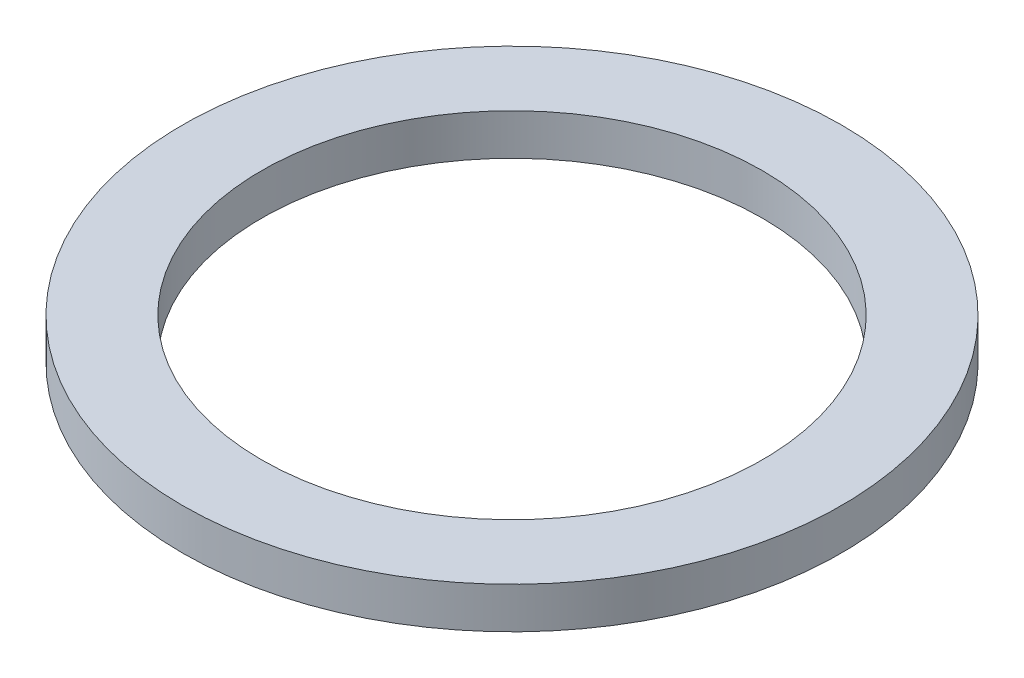
ISO-10303-21;
HEADER;
FILE_DESCRIPTION(('STEP AP214'),'2;1');
FILE_NAME('part.step','',(''),(''),'','','');
FILE_SCHEMA(('AUTOMOTIVE_DESIGN { 1 0 10303 214 1 1 1 1 }'));
ENDSEC;
DATA;
#1=APPLICATION_CONTEXT('core data for automotive mechanical design processes');
#2=APPLICATION_PROTOCOL_DEFINITION('international standard','automotive_design',2000,#1);
#3=PRODUCT_CONTEXT('',#1,'mechanical');
#4=PRODUCT('Part','Part','',(#3));
#5=PRODUCT_RELATED_PRODUCT_CATEGORY('part','',(#4));
#6=PRODUCT_DEFINITION_FORMATION('','',#4);
#7=PRODUCT_DEFINITION_CONTEXT('part definition',#1,'design');
#8=PRODUCT_DEFINITION('design','',#6,#7);
#9=PRODUCT_DEFINITION_SHAPE('','',#8);
#10=(LENGTH_UNIT() NAMED_UNIT(*) SI_UNIT(.MILLI.,.METRE.));
#11=(NAMED_UNIT(*) PLANE_ANGLE_UNIT() SI_UNIT($,.RADIAN.));
#12=(NAMED_UNIT(*) SI_UNIT($,.STERADIAN.) SOLID_ANGLE_UNIT());
#13=UNCERTAINTY_MEASURE_WITH_UNIT(LENGTH_MEASURE(1.E-05),#10,'distance_accuracy_value','');
#14=(GEOMETRIC_REPRESENTATION_CONTEXT(3) GLOBAL_UNCERTAINTY_ASSIGNED_CONTEXT((#13)) GLOBAL_UNIT_ASSIGNED_CONTEXT((#10,
#11,#12)) REPRESENTATION_CONTEXT('',''));
#15=CARTESIAN_POINT('',(0.,0.,0.));
#16=DIRECTION('',(0.,0.,1.));
#17=DIRECTION('',(1.,0.,0.));
#18=AXIS2_PLACEMENT_3D('',#15,#16,#17);
#19=CARTESIAN_POINT('',(0.,1.5875,0.));
#20=DIRECTION('',(0.,1.,0.));
#21=DIRECTION('',(0.,0.,1.));
#22=AXIS2_PLACEMENT_3D('',#19,#20,#21);
#23=PLANE('',#22);
#24=CARTESIAN_POINT('',(0.,1.5875,0.));
#25=DIRECTION('',(0.,1.,0.));
#26=DIRECTION('',(0.,0.,1.));
#27=AXIS2_PLACEMENT_3D('',#24,#25,#26);
#28=CIRCLE('',#27,12.7);
#29=CARTESIAN_POINT('',(0.,1.5875,12.7));
#30=VERTEX_POINT('',#29);
#31=EDGE_CURVE('E10',#30,#30,#28,.T.);
#32=ORIENTED_EDGE('',*,*,#31,.T.);
#33=EDGE_LOOP('',(#32));
#34=FACE_BOUND('',#33,.T.);
#35=CARTESIAN_POINT('',(0.,1.5875,0.));
#36=DIRECTION('',(0.,1.,0.));
#37=DIRECTION('',(0.,0.,1.));
#38=AXIS2_PLACEMENT_3D('',#35,#36,#37);
#39=CIRCLE('',#38,9.652);
#40=CARTESIAN_POINT('',(0.,1.5875,9.652));
#41=VERTEX_POINT('',#40);
#42=EDGE_CURVE('E50',#41,#41,#39,.T.);
#43=ORIENTED_EDGE('',*,*,#42,.F.);
#44=EDGE_LOOP('',(#43));
#45=FACE_BOUND('',#44,.T.);
#46=ADVANCED_FACE('F36',(#34,#45),#23,.T.);
#47=CARTESIAN_POINT('',(0.,0.,0.));
#48=DIRECTION('',(0.,1.,0.));
#49=DIRECTION('',(0.,0.,1.));
#50=AXIS2_PLACEMENT_3D('',#47,#48,#49);
#51=PLANE('',#50);
#52=CARTESIAN_POINT('',(0.,0.,0.));
#53=DIRECTION('',(0.,1.,0.));
#54=DIRECTION('',(0.,0.,1.));
#55=AXIS2_PLACEMENT_3D('',#52,#53,#54);
#56=CIRCLE('',#55,12.7);
#57=CARTESIAN_POINT('',(0.,0.,12.7));
#58=VERTEX_POINT('',#57);
#59=EDGE_CURVE('E40',#58,#58,#56,.T.);
#60=ORIENTED_EDGE('',*,*,#59,.F.);
#61=EDGE_LOOP('',(#60));
#62=FACE_BOUND('',#61,.T.);
#63=CARTESIAN_POINT('',(0.,0.,0.));
#64=DIRECTION('',(0.,1.,0.));
#65=DIRECTION('',(0.,0.,1.));
#66=AXIS2_PLACEMENT_3D('',#63,#64,#65);
#67=CIRCLE('',#66,9.652);
#68=CARTESIAN_POINT('',(0.,0.,9.652));
#69=VERTEX_POINT('',#68);
#70=EDGE_CURVE('E52',#69,#69,#67,.T.);
#71=ORIENTED_EDGE('',*,*,#70,.T.);
#72=EDGE_LOOP('',(#71));
#73=FACE_BOUND('',#72,.T.);
#74=ADVANCED_FACE('F63',(#62,#73),#51,.F.);
#75=CARTESIAN_POINT('',(0.,1.5875,0.));
#76=DIRECTION('',(0.,-1.,0.));
#77=DIRECTION('',(0.,0.,-1.));
#78=AXIS2_PLACEMENT_3D('',#75,#76,#77);
#79=CYLINDRICAL_SURFACE('',#78,12.7);
#80=ORIENTED_EDGE('',*,*,#31,.F.);
#81=EDGE_LOOP('',(#80));
#82=FACE_BOUND('',#81,.T.);
#83=ORIENTED_EDGE('',*,*,#59,.T.);
#84=EDGE_LOOP('',(#83));
#85=FACE_BOUND('',#84,.T.);
#86=ADVANCED_FACE('F38',(#82,#85),#79,.T.);
#87=CARTESIAN_POINT('',(0.,1.5875,0.));
#88=DIRECTION('',(0.,-1.,0.));
#89=DIRECTION('',(0.,0.,-1.));
#90=AXIS2_PLACEMENT_3D('',#87,#88,#89);
#91=CYLINDRICAL_SURFACE('',#90,9.652);
#92=ORIENTED_EDGE('',*,*,#42,.T.);
#93=EDGE_LOOP('',(#92));
#94=FACE_BOUND('',#93,.T.);
#95=ORIENTED_EDGE('',*,*,#70,.F.);
#96=EDGE_LOOP('',(#95));
#97=FACE_BOUND('',#96,.T.);
#98=ADVANCED_FACE('F59',(#94,#97),#91,.F.);
#99=CLOSED_SHELL('',(#46,#74,#86,#98));
#100=MANIFOLD_SOLID_BREP('B2',#99);
#101=ADVANCED_BREP_SHAPE_REPRESENTATION('',(#18,#100),#14);
#102=SHAPE_DEFINITION_REPRESENTATION(#9,#101);
ENDSEC;
END-ISO-10303-21;
